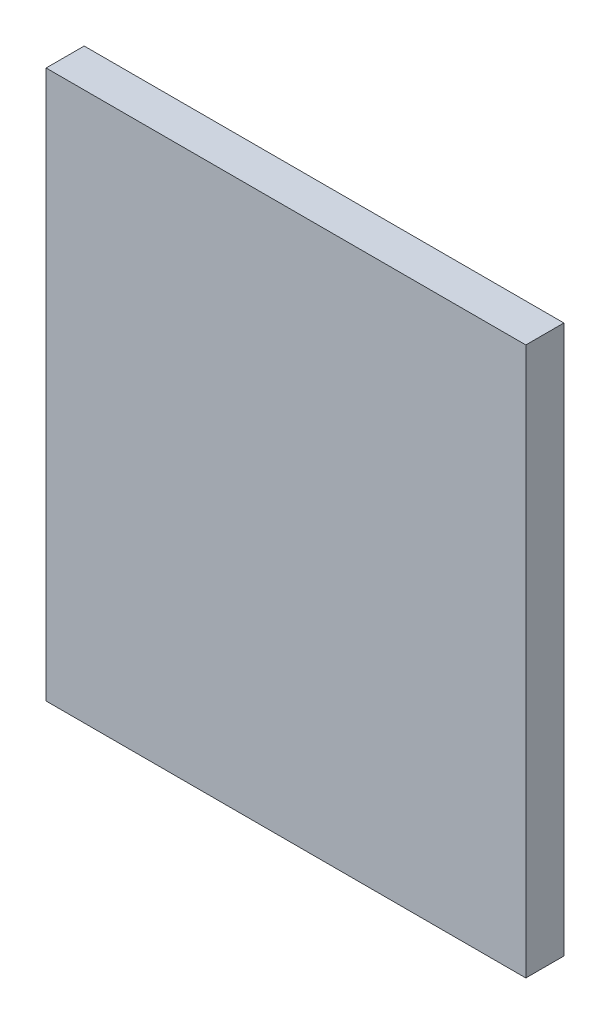
ISO-10303-21;
HEADER;
FILE_DESCRIPTION(('STEP AP214'),'2;1');
FILE_NAME('part.step','',(''),(''),'','','');
FILE_SCHEMA(('AUTOMOTIVE_DESIGN { 1 0 10303 214 1 1 1 1 }'));
ENDSEC;
DATA;
#1=APPLICATION_CONTEXT('core data for automotive mechanical design processes');
#2=APPLICATION_PROTOCOL_DEFINITION('international standard','automotive_design',2000,#1);
#3=PRODUCT_CONTEXT('',#1,'mechanical');
#4=PRODUCT('Part','Part','',(#3));
#5=PRODUCT_RELATED_PRODUCT_CATEGORY('part','',(#4));
#6=PRODUCT_DEFINITION_FORMATION('','',#4);
#7=PRODUCT_DEFINITION_CONTEXT('part definition',#1,'design');
#8=PRODUCT_DEFINITION('design','',#6,#7);
#9=PRODUCT_DEFINITION_SHAPE('','',#8);
#10=(LENGTH_UNIT() NAMED_UNIT(*) SI_UNIT(.MILLI.,.METRE.));
#11=(NAMED_UNIT(*) PLANE_ANGLE_UNIT() SI_UNIT($,.RADIAN.));
#12=(NAMED_UNIT(*) SI_UNIT($,.STERADIAN.) SOLID_ANGLE_UNIT());
#13=UNCERTAINTY_MEASURE_WITH_UNIT(LENGTH_MEASURE(1.E-05),#10,'distance_accuracy_value','');
#14=(GEOMETRIC_REPRESENTATION_CONTEXT(3) GLOBAL_UNCERTAINTY_ASSIGNED_CONTEXT((#13)) GLOBAL_UNIT_ASSIGNED_CONTEXT((#10,
#11,#12)) REPRESENTATION_CONTEXT('',''));
#15=CARTESIAN_POINT('',(0.,0.,0.));
#16=DIRECTION('',(0.,0.,1.));
#17=DIRECTION('',(1.,0.,0.));
#18=AXIS2_PLACEMENT_3D('',#15,#16,#17);
#19=CARTESIAN_POINT('',(-31.5,42.,5.));
#20=DIRECTION('',(1.,0.,0.));
#21=DIRECTION('',(0.,1.,0.));
#22=AXIS2_PLACEMENT_3D('',#19,#20,#21);
#23=PLANE('',#22);
#24=DIRECTION('',(0.,-1.,0.));
#25=VECTOR('',#24,1.);
#26=CARTESIAN_POINT('',(-31.5,42.,0.));
#27=LINE('',#26,#25);
#28=CARTESIAN_POINT('',(-31.5,42.,0.));
#29=VERTEX_POINT('',#28);
#30=CARTESIAN_POINT('',(-31.5,-30.,0.));
#31=VERTEX_POINT('',#30);
#32=EDGE_CURVE('E96',#29,#31,#27,.T.);
#33=ORIENTED_EDGE('',*,*,#32,.T.);
#34=DIRECTION('',(0.,0.,-1.));
#35=VECTOR('',#34,1.);
#36=CARTESIAN_POINT('',(-31.5,-30.,5.));
#37=LINE('',#36,#35);
#38=CARTESIAN_POINT('',(-31.5,-30.,5.));
#39=VERTEX_POINT('',#38);
#40=EDGE_CURVE('E11',#39,#31,#37,.T.);
#41=ORIENTED_EDGE('',*,*,#40,.F.);
#42=DIRECTION('',(0.,-1.,0.));
#43=VECTOR('',#42,1.);
#44=CARTESIAN_POINT('',(-31.5,42.,5.));
#45=LINE('',#44,#43);
#46=CARTESIAN_POINT('',(-31.5,42.,5.));
#47=VERTEX_POINT('',#46);
#48=EDGE_CURVE('E84',#47,#39,#45,.T.);
#49=ORIENTED_EDGE('',*,*,#48,.F.);
#50=DIRECTION('',(0.,0.,-1.));
#51=VECTOR('',#50,1.);
#52=CARTESIAN_POINT('',(-31.5,42.,5.));
#53=LINE('',#52,#51);
#54=EDGE_CURVE('E92',#47,#29,#53,.T.);
#55=ORIENTED_EDGE('',*,*,#54,.T.);
#56=EDGE_LOOP('',(#33,#41,#49,#55));
#57=FACE_BOUND('',#56,.T.);
#58=ADVANCED_FACE('F33',(#57),#23,.F.);
#59=CARTESIAN_POINT('',(-31.5,-30.,5.));
#60=DIRECTION('',(0.,1.,0.));
#61=DIRECTION('',(0.,0.,1.));
#62=AXIS2_PLACEMENT_3D('',#59,#60,#61);
#63=PLANE('',#62);
#64=DIRECTION('',(1.,0.,0.));
#65=VECTOR('',#64,1.);
#66=CARTESIAN_POINT('',(-31.5,-30.,0.));
#67=LINE('',#66,#65);
#68=CARTESIAN_POINT('',(31.5,-30.,0.));
#69=VERTEX_POINT('',#68);
#70=EDGE_CURVE('E88',#31,#69,#67,.T.);
#71=ORIENTED_EDGE('',*,*,#70,.T.);
#72=DIRECTION('',(0.,0.,-1.));
#73=VECTOR('',#72,1.);
#74=CARTESIAN_POINT('',(31.5,-30.,5.));
#75=LINE('',#74,#73);
#76=CARTESIAN_POINT('',(31.5,-30.,5.));
#77=VERTEX_POINT('',#76);
#78=EDGE_CURVE('E41',#77,#69,#75,.T.);
#79=ORIENTED_EDGE('',*,*,#78,.F.);
#80=DIRECTION('',(1.,0.,0.));
#81=VECTOR('',#80,1.);
#82=CARTESIAN_POINT('',(-31.5,-30.,5.));
#83=LINE('',#82,#81);
#84=EDGE_CURVE('E79',#39,#77,#83,.T.);
#85=ORIENTED_EDGE('',*,*,#84,.F.);
#86=ORIENTED_EDGE('',*,*,#40,.T.);
#87=EDGE_LOOP('',(#71,#79,#85,#86));
#88=FACE_BOUND('',#87,.T.);
#89=ADVANCED_FACE('F87',(#88),#63,.F.);
#90=CARTESIAN_POINT('',(31.5,42.,5.));
#91=DIRECTION('',(-1.,0.,0.));
#92=DIRECTION('',(0.,-1.,0.));
#93=AXIS2_PLACEMENT_3D('',#90,#91,#92);
#94=PLANE('',#93);
#95=DIRECTION('',(0.,1.,0.));
#96=VECTOR('',#95,1.);
#97=CARTESIAN_POINT('',(31.5,42.,0.));
#98=LINE('',#97,#96);
#99=CARTESIAN_POINT('',(31.5,42.,0.));
#100=VERTEX_POINT('',#99);
#101=EDGE_CURVE('E66',#69,#100,#98,.T.);
#102=ORIENTED_EDGE('',*,*,#101,.T.);
#103=DIRECTION('',(0.,0.,-1.));
#104=VECTOR('',#103,1.);
#105=CARTESIAN_POINT('',(31.5,42.,5.));
#106=LINE('',#105,#104);
#107=CARTESIAN_POINT('',(31.5,42.,5.));
#108=VERTEX_POINT('',#107);
#109=EDGE_CURVE('E89',#108,#100,#106,.T.);
#110=ORIENTED_EDGE('',*,*,#109,.F.);
#111=DIRECTION('',(0.,1.,0.));
#112=VECTOR('',#111,1.);
#113=CARTESIAN_POINT('',(31.5,42.,5.));
#114=LINE('',#113,#112);
#115=EDGE_CURVE('E82',#77,#108,#114,.T.);
#116=ORIENTED_EDGE('',*,*,#115,.F.);
#117=ORIENTED_EDGE('',*,*,#78,.T.);
#118=EDGE_LOOP('',(#102,#110,#116,#117));
#119=FACE_BOUND('',#118,.T.);
#120=ADVANCED_FACE('F90',(#119),#94,.F.);
#121=CARTESIAN_POINT('',(-31.5,42.,5.));
#122=DIRECTION('',(0.,-1.,0.));
#123=DIRECTION('',(0.,0.,-1.));
#124=AXIS2_PLACEMENT_3D('',#121,#122,#123);
#125=PLANE('',#124);
#126=DIRECTION('',(-1.,0.,0.));
#127=VECTOR('',#126,1.);
#128=CARTESIAN_POINT('',(-31.5,42.,0.));
#129=LINE('',#128,#127);
#130=EDGE_CURVE('E72',#100,#29,#129,.T.);
#131=ORIENTED_EDGE('',*,*,#130,.T.);
#132=ORIENTED_EDGE('',*,*,#54,.F.);
#133=DIRECTION('',(-1.,0.,0.));
#134=VECTOR('',#133,1.);
#135=CARTESIAN_POINT('',(-31.5,42.,5.));
#136=LINE('',#135,#134);
#137=EDGE_CURVE('E49',#108,#47,#136,.T.);
#138=ORIENTED_EDGE('',*,*,#137,.F.);
#139=ORIENTED_EDGE('',*,*,#109,.T.);
#140=EDGE_LOOP('',(#131,#132,#138,#139));
#141=FACE_BOUND('',#140,.T.);
#142=ADVANCED_FACE('F103',(#141),#125,.F.);
#143=CARTESIAN_POINT('',(0.,0.,5.));
#144=DIRECTION('',(0.,0.,1.));
#145=DIRECTION('',(1.,0.,0.));
#146=AXIS2_PLACEMENT_3D('',#143,#144,#145);
#147=PLANE('',#146);
#148=ORIENTED_EDGE('',*,*,#48,.T.);
#149=ORIENTED_EDGE('',*,*,#84,.T.);
#150=ORIENTED_EDGE('',*,*,#115,.T.);
#151=ORIENTED_EDGE('',*,*,#137,.T.);
#152=EDGE_LOOP('',(#148,#149,#150,#151));
#153=FACE_BOUND('',#152,.T.);
#154=ADVANCED_FACE('F80',(#153),#147,.T.);
#155=CARTESIAN_POINT('',(0.,0.,0.));
#156=DIRECTION('',(0.,0.,1.));
#157=DIRECTION('',(1.,0.,0.));
#158=AXIS2_PLACEMENT_3D('',#155,#156,#157);
#159=PLANE('',#158);
#160=ORIENTED_EDGE('',*,*,#32,.F.);
#161=ORIENTED_EDGE('',*,*,#130,.F.);
#162=ORIENTED_EDGE('',*,*,#101,.F.);
#163=ORIENTED_EDGE('',*,*,#70,.F.);
#164=EDGE_LOOP('',(#160,#161,#162,#163));
#165=FACE_BOUND('',#164,.T.);
#166=ADVANCED_FACE('F106',(#165),#159,.F.);
#167=CLOSED_SHELL('',(#58,#89,#120,#142,#154,#166));
#168=MANIFOLD_SOLID_BREP('B2',#167);
#169=ADVANCED_BREP_SHAPE_REPRESENTATION('',(#18,#168),#14);
#170=SHAPE_DEFINITION_REPRESENTATION(#9,#169);
ENDSEC;
END-ISO-10303-21;
